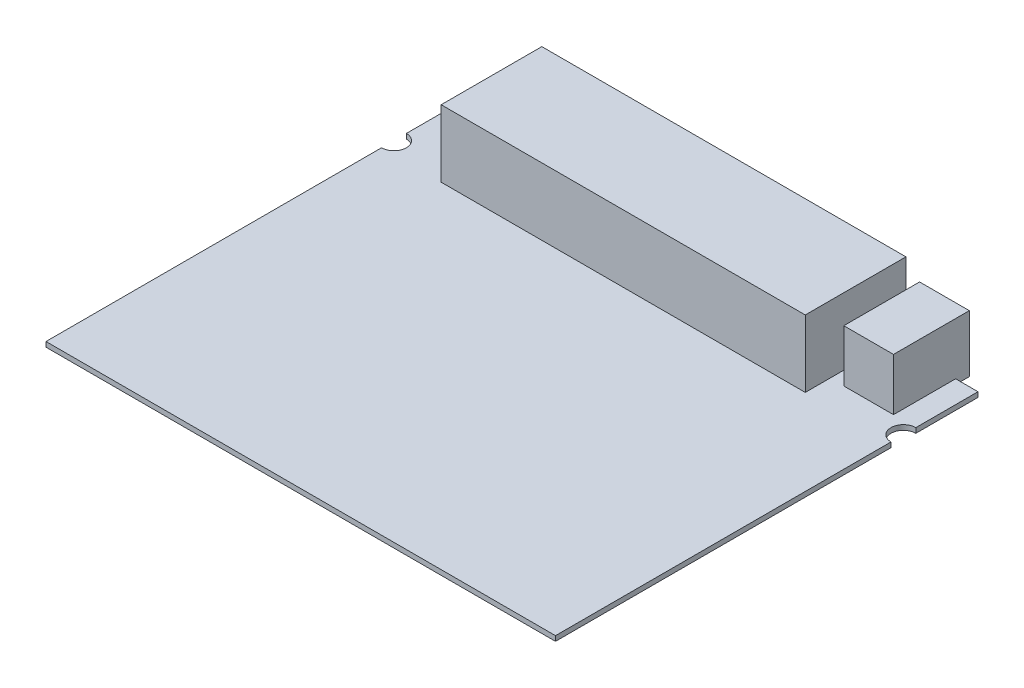
ISO-10303-21;
HEADER;
FILE_DESCRIPTION(('STEP AP214'),'2;1');
FILE_NAME('part.step','',(''),(''),'','','');
FILE_SCHEMA(('AUTOMOTIVE_DESIGN { 1 0 10303 214 1 1 1 1 }'));
ENDSEC;
DATA;
#1=APPLICATION_CONTEXT('core data for automotive mechanical design processes');
#2=APPLICATION_PROTOCOL_DEFINITION('international standard','automotive_design',2000,#1);
#3=PRODUCT_CONTEXT('',#1,'mechanical');
#4=PRODUCT('Part','Part','',(#3));
#5=PRODUCT_RELATED_PRODUCT_CATEGORY('part','',(#4));
#6=PRODUCT_DEFINITION_FORMATION('','',#4);
#7=PRODUCT_DEFINITION_CONTEXT('part definition',#1,'design');
#8=PRODUCT_DEFINITION('design','',#6,#7);
#9=PRODUCT_DEFINITION_SHAPE('','',#8);
#10=(LENGTH_UNIT() NAMED_UNIT(*) SI_UNIT(.MILLI.,.METRE.));
#11=(NAMED_UNIT(*) PLANE_ANGLE_UNIT() SI_UNIT($,.RADIAN.));
#12=(NAMED_UNIT(*) SI_UNIT($,.STERADIAN.) SOLID_ANGLE_UNIT());
#13=UNCERTAINTY_MEASURE_WITH_UNIT(LENGTH_MEASURE(1.E-05),#10,'distance_accuracy_value','');
#14=(GEOMETRIC_REPRESENTATION_CONTEXT(3) GLOBAL_UNCERTAINTY_ASSIGNED_CONTEXT((#13)) GLOBAL_UNIT_ASSIGNED_CONTEXT((#10,
#11,#12)) REPRESENTATION_CONTEXT('',''));
#15=CARTESIAN_POINT('',(0.,0.,0.));
#16=DIRECTION('',(0.,0.,1.));
#17=DIRECTION('',(1.,0.,0.));
#18=AXIS2_PLACEMENT_3D('',#15,#16,#17);
#19=CARTESIAN_POINT('',(34.544,14.732,-25.4));
#20=DIRECTION('',(-1.,0.,0.));
#21=DIRECTION('',(0.,0.,1.));
#22=AXIS2_PLACEMENT_3D('',#19,#20,#21);
#23=PLANE('',#22);
#24=DIRECTION('',(0.,-1.,0.));
#25=VECTOR('',#24,1.);
#26=CARTESIAN_POINT('',(34.544,1.016,-43.18));
#27=LINE('',#26,#25);
#28=CARTESIAN_POINT('',(34.544,1.016,-43.18));
#29=VERTEX_POINT('',#28);
#30=CARTESIAN_POINT('',(34.544,0.,-43.18));
#31=VERTEX_POINT('',#30);
#32=EDGE_CURVE('E236',#29,#31,#27,.T.);
#33=ORIENTED_EDGE('',*,*,#32,.T.);
#34=DIRECTION('',(0.,0.,-1.));
#35=VECTOR('',#34,1.);
#36=CARTESIAN_POINT('',(34.544,0.,-25.4));
#37=LINE('',#36,#35);
#38=CARTESIAN_POINT('',(34.544,0.,-45.974));
#39=VERTEX_POINT('',#38);
#40=EDGE_CURVE('E289',#31,#39,#37,.T.);
#41=ORIENTED_EDGE('',*,*,#40,.T.);
#42=DIRECTION('',(0.,-1.,0.));
#43=VECTOR('',#42,1.);
#44=CARTESIAN_POINT('',(34.544,14.732,-45.974));
#45=LINE('',#44,#43);
#46=CARTESIAN_POINT('',(34.544,14.732,-45.974));
#47=VERTEX_POINT('',#46);
#48=EDGE_CURVE('E41',#47,#39,#45,.T.);
#49=ORIENTED_EDGE('',*,*,#48,.F.);
#50=DIRECTION('',(0.,0.,-1.));
#51=VECTOR('',#50,1.);
#52=CARTESIAN_POINT('',(34.544,14.732,-25.4));
#53=LINE('',#52,#51);
#54=CARTESIAN_POINT('',(34.544,14.732,-25.4));
#55=VERTEX_POINT('',#54);
#56=EDGE_CURVE('E293',#55,#47,#53,.T.);
#57=ORIENTED_EDGE('',*,*,#56,.F.);
#58=DIRECTION('',(0.,-1.,0.));
#59=VECTOR('',#58,1.);
#60=CARTESIAN_POINT('',(34.544,14.732,-25.4));
#61=LINE('',#60,#59);
#62=CARTESIAN_POINT('',(34.544,1.016,-25.4));
#63=VERTEX_POINT('',#62);
#64=EDGE_CURVE('E11',#55,#63,#61,.T.);
#65=ORIENTED_EDGE('',*,*,#64,.T.);
#66=DIRECTION('',(0.,0.,1.));
#67=VECTOR('',#66,1.);
#68=CARTESIAN_POINT('',(34.544,1.016,-25.4));
#69=LINE('',#68,#67);
#70=EDGE_CURVE('E47',#29,#63,#69,.T.);
#71=ORIENTED_EDGE('',*,*,#70,.F.);
#72=EDGE_LOOP('',(#33,#41,#49,#57,#65,#71));
#73=FACE_BOUND('',#72,.T.);
#74=ADVANCED_FACE('F33',(#73),#23,.F.);
#75=CARTESIAN_POINT('',(-39.878,14.732,-25.4));
#76=DIRECTION('',(1.,0.,0.));
#77=DIRECTION('',(0.,0.,-1.));
#78=AXIS2_PLACEMENT_3D('',#75,#76,#77);
#79=PLANE('',#78);
#80=DIRECTION('',(0.,-1.,0.));
#81=VECTOR('',#80,1.);
#82=CARTESIAN_POINT('',(-39.878,1.016,-43.18));
#83=LINE('',#82,#81);
#84=CARTESIAN_POINT('',(-39.878,1.016,-43.18));
#85=VERTEX_POINT('',#84);
#86=CARTESIAN_POINT('',(-39.878,0.,-43.18));
#87=VERTEX_POINT('',#86);
#88=EDGE_CURVE('E286',#85,#87,#83,.T.);
#89=ORIENTED_EDGE('',*,*,#88,.F.);
#90=DIRECTION('',(0.,0.,-1.));
#91=VECTOR('',#90,1.);
#92=CARTESIAN_POINT('',(-39.878,1.016,-25.4));
#93=LINE('',#92,#91);
#94=CARTESIAN_POINT('',(-39.878,1.016,-25.4));
#95=VERTEX_POINT('',#94);
#96=EDGE_CURVE('E204',#95,#85,#93,.T.);
#97=ORIENTED_EDGE('',*,*,#96,.F.);
#98=DIRECTION('',(0.,-1.,0.));
#99=VECTOR('',#98,1.);
#100=CARTESIAN_POINT('',(-39.878,14.732,-25.4));
#101=LINE('',#100,#99);
#102=CARTESIAN_POINT('',(-39.878,14.732,-25.4));
#103=VERTEX_POINT('',#102);
#104=EDGE_CURVE('E300',#103,#95,#101,.T.);
#105=ORIENTED_EDGE('',*,*,#104,.F.);
#106=DIRECTION('',(0.,0.,1.));
#107=VECTOR('',#106,1.);
#108=CARTESIAN_POINT('',(-39.878,14.732,-25.4));
#109=LINE('',#108,#107);
#110=CARTESIAN_POINT('',(-39.878,14.732,-45.974));
#111=VERTEX_POINT('',#110);
#112=EDGE_CURVE('E298',#111,#103,#109,.T.);
#113=ORIENTED_EDGE('',*,*,#112,.F.);
#114=DIRECTION('',(0.,-1.,0.));
#115=VECTOR('',#114,1.);
#116=CARTESIAN_POINT('',(-39.878,14.732,-45.974));
#117=LINE('',#116,#115);
#118=CARTESIAN_POINT('',(-39.878,0.,-45.974));
#119=VERTEX_POINT('',#118);
#120=EDGE_CURVE('E306',#111,#119,#117,.T.);
#121=ORIENTED_EDGE('',*,*,#120,.T.);
#122=DIRECTION('',(0.,0.,1.));
#123=VECTOR('',#122,1.);
#124=CARTESIAN_POINT('',(-39.878,0.,-25.4));
#125=LINE('',#124,#123);
#126=EDGE_CURVE('E294',#119,#87,#125,.T.);
#127=ORIENTED_EDGE('',*,*,#126,.T.);
#128=EDGE_LOOP('',(#89,#97,#105,#113,#121,#127));
#129=FACE_BOUND('',#128,.T.);
#130=ADVANCED_FACE('F323',(#129),#79,.F.);
#131=CARTESIAN_POINT('',(-39.878,14.732,-25.4));
#132=DIRECTION('',(0.,0.,-1.));
#133=DIRECTION('',(-1.,0.,0.));
#134=AXIS2_PLACEMENT_3D('',#131,#132,#133);
#135=PLANE('',#134);
#136=ORIENTED_EDGE('',*,*,#104,.T.);
#137=DIRECTION('',(-1.,0.,0.));
#138=VECTOR('',#137,1.);
#139=CARTESIAN_POINT('',(-39.878,1.016,-25.4));
#140=LINE('',#139,#138);
#141=EDGE_CURVE('E55',#63,#95,#140,.T.);
#142=ORIENTED_EDGE('',*,*,#141,.F.);
#143=ORIENTED_EDGE('',*,*,#64,.F.);
#144=DIRECTION('',(1.,0.,0.));
#145=VECTOR('',#144,1.);
#146=CARTESIAN_POINT('',(-39.878,14.732,-25.4));
#147=LINE('',#146,#145);
#148=EDGE_CURVE('E290',#103,#55,#147,.T.);
#149=ORIENTED_EDGE('',*,*,#148,.F.);
#150=EDGE_LOOP('',(#136,#142,#143,#149));
#151=FACE_BOUND('',#150,.T.);
#152=ADVANCED_FACE('F35',(#151),#135,.F.);
#153=CARTESIAN_POINT('',(-39.878,14.732,-45.974));
#154=DIRECTION('',(0.,0.,1.));
#155=DIRECTION('',(1.,0.,0.));
#156=AXIS2_PLACEMENT_3D('',#153,#154,#155);
#157=PLANE('',#156);
#158=DIRECTION('',(-1.,0.,0.));
#159=VECTOR('',#158,1.);
#160=CARTESIAN_POINT('',(-39.878,0.,-45.974));
#161=LINE('',#160,#159);
#162=EDGE_CURVE('E302',#39,#119,#161,.T.);
#163=ORIENTED_EDGE('',*,*,#162,.T.);
#164=ORIENTED_EDGE('',*,*,#120,.F.);
#165=DIRECTION('',(-1.,0.,0.));
#166=VECTOR('',#165,1.);
#167=CARTESIAN_POINT('',(-39.878,14.732,-45.974));
#168=LINE('',#167,#166);
#169=EDGE_CURVE('E296',#47,#111,#168,.T.);
#170=ORIENTED_EDGE('',*,*,#169,.F.);
#171=ORIENTED_EDGE('',*,*,#48,.T.);
#172=EDGE_LOOP('',(#163,#164,#170,#171));
#173=FACE_BOUND('',#172,.T.);
#174=ADVANCED_FACE('F313',(#173),#157,.F.);
#175=CARTESIAN_POINT('',(0.,14.732,0.));
#176=DIRECTION('',(0.,1.,0.));
#177=DIRECTION('',(0.,0.,1.));
#178=AXIS2_PLACEMENT_3D('',#175,#176,#177);
#179=PLANE('',#178);
#180=ORIENTED_EDGE('',*,*,#148,.T.);
#181=ORIENTED_EDGE('',*,*,#56,.T.);
#182=ORIENTED_EDGE('',*,*,#169,.T.);
#183=ORIENTED_EDGE('',*,*,#112,.T.);
#184=EDGE_LOOP('',(#180,#181,#182,#183));
#185=FACE_BOUND('',#184,.T.);
#186=ADVANCED_FACE('F329',(#185),#179,.T.);
#187=CARTESIAN_POINT('',(0.,0.,0.));
#188=DIRECTION('',(0.,1.,0.));
#189=DIRECTION('',(0.,0.,1.));
#190=AXIS2_PLACEMENT_3D('',#187,#188,#189);
#191=PLANE('',#190);
#192=DIRECTION('',(-1.,0.,0.));
#193=VECTOR('',#192,1.);
#194=CARTESIAN_POINT('',(-39.878,0.,-43.18));
#195=LINE('',#194,#193);
#196=CARTESIAN_POINT('',(-52.07,0.,-43.18));
#197=VERTEX_POINT('',#196);
#198=EDGE_CURVE('E196',#87,#197,#195,.T.);
#199=ORIENTED_EDGE('',*,*,#198,.F.);
#200=ORIENTED_EDGE('',*,*,#126,.F.);
#201=ORIENTED_EDGE('',*,*,#162,.F.);
#202=ORIENTED_EDGE('',*,*,#40,.F.);
#203=DIRECTION('',(-1.,0.,0.));
#204=VECTOR('',#203,1.);
#205=CARTESIAN_POINT('',(37.338,0.,-43.18));
#206=LINE('',#205,#204);
#207=CARTESIAN_POINT('',(37.338,0.,-43.18));
#208=VERTEX_POINT('',#207);
#209=EDGE_CURVE('E208',#208,#31,#206,.T.);
#210=ORIENTED_EDGE('',*,*,#209,.F.);
#211=DIRECTION('',(0.,0.,1.));
#212=VECTOR('',#211,1.);
#213=CARTESIAN_POINT('',(37.338,0.,-30.48));
#214=LINE('',#213,#212);
#215=CARTESIAN_POINT('',(37.338,0.,-45.974));
#216=VERTEX_POINT('',#215);
#217=EDGE_CURVE('E191',#216,#208,#214,.T.);
#218=ORIENTED_EDGE('',*,*,#217,.F.);
#219=DIRECTION('',(-1.,0.,0.));
#220=VECTOR('',#219,1.);
#221=CARTESIAN_POINT('',(37.338,0.,-45.974));
#222=LINE('',#221,#220);
#223=CARTESIAN_POINT('',(47.498,0.,-45.974));
#224=VERTEX_POINT('',#223);
#225=EDGE_CURVE('E339',#224,#216,#222,.T.);
#226=ORIENTED_EDGE('',*,*,#225,.F.);
#227=DIRECTION('',(0.,0.,-1.));
#228=VECTOR('',#227,1.);
#229=CARTESIAN_POINT('',(47.498,0.,-30.48));
#230=LINE('',#229,#228);
#231=CARTESIAN_POINT('',(47.498,0.,-43.18));
#232=VERTEX_POINT('',#231);
#233=EDGE_CURVE('E343',#232,#224,#230,.T.);
#234=ORIENTED_EDGE('',*,*,#233,.F.);
#235=DIRECTION('',(-1.,0.,0.));
#236=VECTOR('',#235,1.);
#237=CARTESIAN_POINT('',(52.07,0.,-43.18));
#238=LINE('',#237,#236);
#239=CARTESIAN_POINT('',(52.07,0.,-43.18));
#240=VERTEX_POINT('',#239);
#241=EDGE_CURVE('E251',#240,#232,#238,.T.);
#242=ORIENTED_EDGE('',*,*,#241,.F.);
#243=DIRECTION('',(0.,0.,-1.));
#244=VECTOR('',#243,1.);
#245=CARTESIAN_POINT('',(52.07,0.,-30.48));
#246=LINE('',#245,#244);
#247=CARTESIAN_POINT('',(52.07,0.,-30.48));
#248=VERTEX_POINT('',#247);
#249=EDGE_CURVE('E249',#248,#240,#246,.T.);
#250=ORIENTED_EDGE('',*,*,#249,.F.);
#251=CARTESIAN_POINT('',(52.07,0.,-27.94));
#252=DIRECTION('',(0.,-1.,0.));
#253=DIRECTION('',(0.,0.,1.));
#254=AXIS2_PLACEMENT_3D('',#251,#252,#253);
#255=CIRCLE('',#254,2.53999999999999);
#256=CARTESIAN_POINT('',(52.07,0.,-25.4));
#257=VERTEX_POINT('',#256);
#258=EDGE_CURVE('E247',#257,#248,#255,.T.);
#259=ORIENTED_EDGE('',*,*,#258,.F.);
#260=DIRECTION('',(0.,0.,-1.));
#261=VECTOR('',#260,1.);
#262=CARTESIAN_POINT('',(52.07,0.,43.18));
#263=LINE('',#262,#261);
#264=CARTESIAN_POINT('',(52.07,0.,43.18));
#265=VERTEX_POINT('',#264);
#266=EDGE_CURVE('E245',#265,#257,#263,.T.);
#267=ORIENTED_EDGE('',*,*,#266,.F.);
#268=DIRECTION('',(1.,0.,0.));
#269=VECTOR('',#268,1.);
#270=CARTESIAN_POINT('',(-52.07,0.,43.18));
#271=LINE('',#270,#269);
#272=CARTESIAN_POINT('',(-52.07,0.,43.18));
#273=VERTEX_POINT('',#272);
#274=EDGE_CURVE('E243',#273,#265,#271,.T.);
#275=ORIENTED_EDGE('',*,*,#274,.F.);
#276=DIRECTION('',(0.,0.,1.));
#277=VECTOR('',#276,1.);
#278=CARTESIAN_POINT('',(-52.07,0.,43.18));
#279=LINE('',#278,#277);
#280=CARTESIAN_POINT('',(-52.07,0.,-25.4));
#281=VERTEX_POINT('',#280);
#282=EDGE_CURVE('E241',#281,#273,#279,.T.);
#283=ORIENTED_EDGE('',*,*,#282,.F.);
#284=CARTESIAN_POINT('',(-52.07,0.,-27.94));
#285=DIRECTION('',(0.,-1.,0.));
#286=DIRECTION('',(0.,0.,1.));
#287=AXIS2_PLACEMENT_3D('',#284,#285,#286);
#288=CIRCLE('',#287,2.53999999999999);
#289=CARTESIAN_POINT('',(-52.07,0.,-30.48));
#290=VERTEX_POINT('',#289);
#291=EDGE_CURVE('E239',#290,#281,#288,.T.);
#292=ORIENTED_EDGE('',*,*,#291,.F.);
#293=DIRECTION('',(0.,0.,1.));
#294=VECTOR('',#293,1.);
#295=CARTESIAN_POINT('',(-52.07,0.,-30.48));
#296=LINE('',#295,#294);
#297=EDGE_CURVE('E198',#197,#290,#296,.T.);
#298=ORIENTED_EDGE('',*,*,#297,.F.);
#299=EDGE_LOOP('',(#199,#200,#201,#202,#210,#218,#226,#234,#242,#250,#259,#267,#275,#283,#292,#298));
#300=FACE_BOUND('',#299,.T.);
#301=ADVANCED_FACE('F319',(#300),#191,.F.);
#302=CARTESIAN_POINT('',(-39.878,1.016,-43.18));
#303=DIRECTION('',(0.,0.,1.));
#304=DIRECTION('',(1.,0.,0.));
#305=AXIS2_PLACEMENT_3D('',#302,#303,#304);
#306=PLANE('',#305);
#307=ORIENTED_EDGE('',*,*,#198,.T.);
#308=DIRECTION('',(0.,-1.,0.));
#309=VECTOR('',#308,1.);
#310=CARTESIAN_POINT('',(-52.07,1.016,-43.18));
#311=LINE('',#310,#309);
#312=CARTESIAN_POINT('',(-52.07,1.016,-43.18));
#313=VERTEX_POINT('',#312);
#314=EDGE_CURVE('E283',#313,#197,#311,.T.);
#315=ORIENTED_EDGE('',*,*,#314,.F.);
#316=DIRECTION('',(-1.,0.,0.));
#317=VECTOR('',#316,1.);
#318=CARTESIAN_POINT('',(-39.878,1.016,-43.18));
#319=LINE('',#318,#317);
#320=EDGE_CURVE('E207',#85,#313,#319,.T.);
#321=ORIENTED_EDGE('',*,*,#320,.F.);
#322=ORIENTED_EDGE('',*,*,#88,.T.);
#323=EDGE_LOOP('',(#307,#315,#321,#322));
#324=FACE_BOUND('',#323,.T.);
#325=ADVANCED_FACE('F395',(#324),#306,.F.);
#326=CARTESIAN_POINT('',(-52.07,1.016,-30.48));
#327=DIRECTION('',(1.,0.,0.));
#328=DIRECTION('',(0.,0.,-1.));
#329=AXIS2_PLACEMENT_3D('',#326,#327,#328);
#330=PLANE('',#329);
#331=ORIENTED_EDGE('',*,*,#297,.T.);
#332=DIRECTION('',(0.,-1.,0.));
#333=VECTOR('',#332,1.);
#334=CARTESIAN_POINT('',(-52.07,1.016,-30.48));
#335=LINE('',#334,#333);
#336=CARTESIAN_POINT('',(-52.07,1.016,-30.48));
#337=VERTEX_POINT('',#336);
#338=EDGE_CURVE('E280',#337,#290,#335,.T.);
#339=ORIENTED_EDGE('',*,*,#338,.F.);
#340=DIRECTION('',(0.,0.,1.));
#341=VECTOR('',#340,1.);
#342=CARTESIAN_POINT('',(-52.07,1.016,-30.48));
#343=LINE('',#342,#341);
#344=EDGE_CURVE('E210',#313,#337,#343,.T.);
#345=ORIENTED_EDGE('',*,*,#344,.F.);
#346=ORIENTED_EDGE('',*,*,#314,.T.);
#347=EDGE_LOOP('',(#331,#339,#345,#346));
#348=FACE_BOUND('',#347,.T.);
#349=ADVANCED_FACE('F392',(#348),#330,.F.);
#350=CARTESIAN_POINT('',(-52.07,1.016,-27.94));
#351=DIRECTION('',(0.,-1.,0.));
#352=DIRECTION('',(0.,0.,-1.));
#353=AXIS2_PLACEMENT_3D('',#350,#351,#352);
#354=CYLINDRICAL_SURFACE('',#353,2.53999999999999);
#355=ORIENTED_EDGE('',*,*,#291,.T.);
#356=DIRECTION('',(0.,-1.,0.));
#357=VECTOR('',#356,1.);
#358=CARTESIAN_POINT('',(-52.07,1.016,-25.4));
#359=LINE('',#358,#357);
#360=CARTESIAN_POINT('',(-52.07,1.016,-25.4));
#361=VERTEX_POINT('',#360);
#362=EDGE_CURVE('E277',#361,#281,#359,.T.);
#363=ORIENTED_EDGE('',*,*,#362,.F.);
#364=CARTESIAN_POINT('',(-52.07,1.016,-27.94));
#365=DIRECTION('',(0.,-1.,0.));
#366=DIRECTION('',(0.,0.,1.));
#367=AXIS2_PLACEMENT_3D('',#364,#365,#366);
#368=CIRCLE('',#367,2.53999999999999);
#369=EDGE_CURVE('E212',#337,#361,#368,.T.);
#370=ORIENTED_EDGE('',*,*,#369,.F.);
#371=ORIENTED_EDGE('',*,*,#338,.T.);
#372=EDGE_LOOP('',(#355,#363,#370,#371));
#373=FACE_BOUND('',#372,.T.);
#374=ADVANCED_FACE('F388',(#373),#354,.F.);
#375=CARTESIAN_POINT('',(-52.07,1.016,43.18));
#376=DIRECTION('',(1.,0.,0.));
#377=DIRECTION('',(0.,0.,-1.));
#378=AXIS2_PLACEMENT_3D('',#375,#376,#377);
#379=PLANE('',#378);
#380=ORIENTED_EDGE('',*,*,#282,.T.);
#381=DIRECTION('',(0.,-1.,0.));
#382=VECTOR('',#381,1.);
#383=CARTESIAN_POINT('',(-52.07,1.016,43.18));
#384=LINE('',#383,#382);
#385=CARTESIAN_POINT('',(-52.07,1.016,43.18));
#386=VERTEX_POINT('',#385);
#387=EDGE_CURVE('E274',#386,#273,#384,.T.);
#388=ORIENTED_EDGE('',*,*,#387,.F.);
#389=DIRECTION('',(0.,0.,1.));
#390=VECTOR('',#389,1.);
#391=CARTESIAN_POINT('',(-52.07,1.016,43.18));
#392=LINE('',#391,#390);
#393=EDGE_CURVE('E214',#361,#386,#392,.T.);
#394=ORIENTED_EDGE('',*,*,#393,.F.);
#395=ORIENTED_EDGE('',*,*,#362,.T.);
#396=EDGE_LOOP('',(#380,#388,#394,#395));
#397=FACE_BOUND('',#396,.T.);
#398=ADVANCED_FACE('F383',(#397),#379,.F.);
#399=CARTESIAN_POINT('',(-52.07,1.016,43.18));
#400=DIRECTION('',(0.,0.,-1.));
#401=DIRECTION('',(-1.,0.,0.));
#402=AXIS2_PLACEMENT_3D('',#399,#400,#401);
#403=PLANE('',#402);
#404=ORIENTED_EDGE('',*,*,#274,.T.);
#405=DIRECTION('',(0.,-1.,0.));
#406=VECTOR('',#405,1.);
#407=CARTESIAN_POINT('',(52.07,1.016,43.18));
#408=LINE('',#407,#406);
#409=CARTESIAN_POINT('',(52.07,1.016,43.18));
#410=VERTEX_POINT('',#409);
#411=EDGE_CURVE('E271',#410,#265,#408,.T.);
#412=ORIENTED_EDGE('',*,*,#411,.F.);
#413=DIRECTION('',(1.,0.,0.));
#414=VECTOR('',#413,1.);
#415=CARTESIAN_POINT('',(-52.07,1.016,43.18));
#416=LINE('',#415,#414);
#417=EDGE_CURVE('E216',#386,#410,#416,.T.);
#418=ORIENTED_EDGE('',*,*,#417,.F.);
#419=ORIENTED_EDGE('',*,*,#387,.T.);
#420=EDGE_LOOP('',(#404,#412,#418,#419));
#421=FACE_BOUND('',#420,.T.);
#422=ADVANCED_FACE('F378',(#421),#403,.F.);
#423=CARTESIAN_POINT('',(52.07,1.016,43.18));
#424=DIRECTION('',(-1.,0.,0.));
#425=DIRECTION('',(0.,0.,1.));
#426=AXIS2_PLACEMENT_3D('',#423,#424,#425);
#427=PLANE('',#426);
#428=ORIENTED_EDGE('',*,*,#266,.T.);
#429=DIRECTION('',(0.,-1.,0.));
#430=VECTOR('',#429,1.);
#431=CARTESIAN_POINT('',(52.07,1.016,-25.4));
#432=LINE('',#431,#430);
#433=CARTESIAN_POINT('',(52.07,1.016,-25.4));
#434=VERTEX_POINT('',#433);
#435=EDGE_CURVE('E268',#434,#257,#432,.T.);
#436=ORIENTED_EDGE('',*,*,#435,.F.);
#437=DIRECTION('',(0.,0.,-1.));
#438=VECTOR('',#437,1.);
#439=CARTESIAN_POINT('',(52.07,1.016,43.18));
#440=LINE('',#439,#438);
#441=EDGE_CURVE('E218',#410,#434,#440,.T.);
#442=ORIENTED_EDGE('',*,*,#441,.F.);
#443=ORIENTED_EDGE('',*,*,#411,.T.);
#444=EDGE_LOOP('',(#428,#436,#442,#443));
#445=FACE_BOUND('',#444,.T.);
#446=ADVANCED_FACE('F374',(#445),#427,.F.);
#447=CARTESIAN_POINT('',(52.07,1.016,-27.94));
#448=DIRECTION('',(0.,-1.,0.));
#449=DIRECTION('',(0.,0.,-1.));
#450=AXIS2_PLACEMENT_3D('',#447,#448,#449);
#451=CYLINDRICAL_SURFACE('',#450,2.53999999999999);
#452=ORIENTED_EDGE('',*,*,#258,.T.);
#453=DIRECTION('',(0.,-1.,0.));
#454=VECTOR('',#453,1.);
#455=CARTESIAN_POINT('',(52.07,1.016,-30.48));
#456=LINE('',#455,#454);
#457=CARTESIAN_POINT('',(52.07,1.016,-30.48));
#458=VERTEX_POINT('',#457);
#459=EDGE_CURVE('E265',#458,#248,#456,.T.);
#460=ORIENTED_EDGE('',*,*,#459,.F.);
#461=CARTESIAN_POINT('',(52.07,1.016,-27.94));
#462=DIRECTION('',(0.,-1.,0.));
#463=DIRECTION('',(0.,0.,1.));
#464=AXIS2_PLACEMENT_3D('',#461,#462,#463);
#465=CIRCLE('',#464,2.53999999999999);
#466=EDGE_CURVE('E220',#434,#458,#465,.T.);
#467=ORIENTED_EDGE('',*,*,#466,.F.);
#468=ORIENTED_EDGE('',*,*,#435,.T.);
#469=EDGE_LOOP('',(#452,#460,#467,#468));
#470=FACE_BOUND('',#469,.T.);
#471=ADVANCED_FACE('F369',(#470),#451,.F.);
#472=CARTESIAN_POINT('',(52.07,1.016,-30.48));
#473=DIRECTION('',(-1.,0.,0.));
#474=DIRECTION('',(0.,0.,1.));
#475=AXIS2_PLACEMENT_3D('',#472,#473,#474);
#476=PLANE('',#475);
#477=ORIENTED_EDGE('',*,*,#249,.T.);
#478=DIRECTION('',(0.,-1.,0.));
#479=VECTOR('',#478,1.);
#480=CARTESIAN_POINT('',(52.07,1.016,-43.18));
#481=LINE('',#480,#479);
#482=CARTESIAN_POINT('',(52.07,1.016,-43.18));
#483=VERTEX_POINT('',#482);
#484=EDGE_CURVE('E262',#483,#240,#481,.T.);
#485=ORIENTED_EDGE('',*,*,#484,.F.);
#486=DIRECTION('',(0.,0.,-1.));
#487=VECTOR('',#486,1.);
#488=CARTESIAN_POINT('',(52.07,1.016,-30.48));
#489=LINE('',#488,#487);
#490=EDGE_CURVE('E222',#458,#483,#489,.T.);
#491=ORIENTED_EDGE('',*,*,#490,.F.);
#492=ORIENTED_EDGE('',*,*,#459,.T.);
#493=EDGE_LOOP('',(#477,#485,#491,#492));
#494=FACE_BOUND('',#493,.T.);
#495=ADVANCED_FACE('F363',(#494),#476,.F.);
#496=CARTESIAN_POINT('',(52.07,1.016,-43.18));
#497=DIRECTION('',(0.,0.,1.));
#498=DIRECTION('',(1.,0.,0.));
#499=AXIS2_PLACEMENT_3D('',#496,#497,#498);
#500=PLANE('',#499);
#501=ORIENTED_EDGE('',*,*,#241,.T.);
#502=DIRECTION('',(0.,-1.,0.));
#503=VECTOR('',#502,1.);
#504=CARTESIAN_POINT('',(47.498,1.016,-43.18));
#505=LINE('',#504,#503);
#506=CARTESIAN_POINT('',(47.498,1.016,-43.18));
#507=VERTEX_POINT('',#506);
#508=EDGE_CURVE('E260',#507,#232,#505,.T.);
#509=ORIENTED_EDGE('',*,*,#508,.F.);
#510=DIRECTION('',(-1.,0.,0.));
#511=VECTOR('',#510,1.);
#512=CARTESIAN_POINT('',(52.07,1.016,-43.18));
#513=LINE('',#512,#511);
#514=EDGE_CURVE('E224',#483,#507,#513,.T.);
#515=ORIENTED_EDGE('',*,*,#514,.F.);
#516=ORIENTED_EDGE('',*,*,#484,.T.);
#517=EDGE_LOOP('',(#501,#509,#515,#516));
#518=FACE_BOUND('',#517,.T.);
#519=ADVANCED_FACE('F358',(#518),#500,.F.);
#520=CARTESIAN_POINT('',(37.338,1.016,-43.18));
#521=DIRECTION('',(0.,0.,1.));
#522=DIRECTION('',(1.,0.,0.));
#523=AXIS2_PLACEMENT_3D('',#520,#521,#522);
#524=PLANE('',#523);
#525=ORIENTED_EDGE('',*,*,#209,.T.);
#526=ORIENTED_EDGE('',*,*,#32,.F.);
#527=DIRECTION('',(-1.,0.,0.));
#528=VECTOR('',#527,1.);
#529=CARTESIAN_POINT('',(37.338,1.016,-43.18));
#530=LINE('',#529,#528);
#531=CARTESIAN_POINT('',(37.338,1.016,-43.18));
#532=VERTEX_POINT('',#531);
#533=EDGE_CURVE('E233',#532,#29,#530,.T.);
#534=ORIENTED_EDGE('',*,*,#533,.F.);
#535=DIRECTION('',(0.,-1.,0.));
#536=VECTOR('',#535,1.);
#537=CARTESIAN_POINT('',(37.338,1.016,-43.18));
#538=LINE('',#537,#536);
#539=EDGE_CURVE('E257',#532,#208,#538,.T.);
#540=ORIENTED_EDGE('',*,*,#539,.T.);
#541=EDGE_LOOP('',(#525,#526,#534,#540));
#542=FACE_BOUND('',#541,.T.);
#543=ADVANCED_FACE('F335',(#542),#524,.F.);
#544=CARTESIAN_POINT('',(-52.07,1.016,-27.94));
#545=DIRECTION('',(0.,1.,0.));
#546=DIRECTION('',(0.,0.,1.));
#547=AXIS2_PLACEMENT_3D('',#544,#545,#546);
#548=PLANE('',#547);
#549=ORIENTED_EDGE('',*,*,#96,.T.);
#550=ORIENTED_EDGE('',*,*,#320,.T.);
#551=ORIENTED_EDGE('',*,*,#344,.T.);
#552=ORIENTED_EDGE('',*,*,#369,.T.);
#553=ORIENTED_EDGE('',*,*,#393,.T.);
#554=ORIENTED_EDGE('',*,*,#417,.T.);
#555=ORIENTED_EDGE('',*,*,#441,.T.);
#556=ORIENTED_EDGE('',*,*,#466,.T.);
#557=ORIENTED_EDGE('',*,*,#490,.T.);
#558=ORIENTED_EDGE('',*,*,#514,.T.);
#559=DIRECTION('',(0.,0.,1.));
#560=VECTOR('',#559,1.);
#561=CARTESIAN_POINT('',(47.498,1.016,-30.48));
#562=LINE('',#561,#560);
#563=CARTESIAN_POINT('',(47.498,1.016,-30.48));
#564=VERTEX_POINT('',#563);
#565=EDGE_CURVE('E227',#507,#564,#562,.T.);
#566=ORIENTED_EDGE('',*,*,#565,.T.);
#567=DIRECTION('',(-1.,0.,0.));
#568=VECTOR('',#567,1.);
#569=CARTESIAN_POINT('',(47.498,1.016,-30.48));
#570=LINE('',#569,#568);
#571=CARTESIAN_POINT('',(37.338,1.016,-30.48));
#572=VERTEX_POINT('',#571);
#573=EDGE_CURVE('E195',#564,#572,#570,.T.);
#574=ORIENTED_EDGE('',*,*,#573,.T.);
#575=DIRECTION('',(0.,0.,-1.));
#576=VECTOR('',#575,1.);
#577=CARTESIAN_POINT('',(37.338,1.016,-30.48));
#578=LINE('',#577,#576);
#579=EDGE_CURVE('E230',#572,#532,#578,.T.);
#580=ORIENTED_EDGE('',*,*,#579,.T.);
#581=ORIENTED_EDGE('',*,*,#533,.T.);
#582=ORIENTED_EDGE('',*,*,#70,.T.);
#583=ORIENTED_EDGE('',*,*,#141,.T.);
#584=EDGE_LOOP('',(#549,#550,#551,#552,#553,#554,#555,#556,#557,#558,#566,#574,#580,#581,#582,#583));
#585=FACE_BOUND('',#584,.T.);
#586=ADVANCED_FACE('F331',(#585),#548,.T.);
#587=CARTESIAN_POINT('',(47.498,11.684,-30.48));
#588=DIRECTION('',(-1.,0.,0.));
#589=DIRECTION('',(0.,0.,1.));
#590=AXIS2_PLACEMENT_3D('',#587,#588,#589);
#591=PLANE('',#590);
#592=ORIENTED_EDGE('',*,*,#565,.F.);
#593=ORIENTED_EDGE('',*,*,#508,.T.);
#594=ORIENTED_EDGE('',*,*,#233,.T.);
#595=DIRECTION('',(0.,-1.,0.));
#596=VECTOR('',#595,1.);
#597=CARTESIAN_POINT('',(47.498,11.684,-45.974));
#598=LINE('',#597,#596);
#599=CARTESIAN_POINT('',(47.498,11.684,-45.974));
#600=VERTEX_POINT('',#599);
#601=EDGE_CURVE('E178',#600,#224,#598,.T.);
#602=ORIENTED_EDGE('',*,*,#601,.F.);
#603=DIRECTION('',(0.,0.,-1.));
#604=VECTOR('',#603,1.);
#605=CARTESIAN_POINT('',(47.498,11.684,-30.48));
#606=LINE('',#605,#604);
#607=CARTESIAN_POINT('',(47.498,11.684,-30.48));
#608=VERTEX_POINT('',#607);
#609=EDGE_CURVE('E171',#608,#600,#606,.T.);
#610=ORIENTED_EDGE('',*,*,#609,.F.);
#611=DIRECTION('',(0.,-1.,0.));
#612=VECTOR('',#611,1.);
#613=CARTESIAN_POINT('',(47.498,11.684,-30.48));
#614=LINE('',#613,#612);
#615=EDGE_CURVE('E175',#608,#564,#614,.T.);
#616=ORIENTED_EDGE('',*,*,#615,.T.);
#617=EDGE_LOOP('',(#592,#593,#594,#602,#610,#616));
#618=FACE_BOUND('',#617,.T.);
#619=ADVANCED_FACE('F173',(#618),#591,.F.);
#620=CARTESIAN_POINT('',(37.338,11.684,-30.48));
#621=DIRECTION('',(1.,0.,0.));
#622=DIRECTION('',(0.,0.,-1.));
#623=AXIS2_PLACEMENT_3D('',#620,#621,#622);
#624=PLANE('',#623);
#625=ORIENTED_EDGE('',*,*,#217,.T.);
#626=ORIENTED_EDGE('',*,*,#539,.F.);
#627=ORIENTED_EDGE('',*,*,#579,.F.);
#628=DIRECTION('',(0.,-1.,0.));
#629=VECTOR('',#628,1.);
#630=CARTESIAN_POINT('',(37.338,11.684,-30.48));
#631=LINE('',#630,#629);
#632=CARTESIAN_POINT('',(37.338,11.684,-30.48));
#633=VERTEX_POINT('',#632);
#634=EDGE_CURVE('E347',#633,#572,#631,.T.);
#635=ORIENTED_EDGE('',*,*,#634,.F.);
#636=DIRECTION('',(0.,0.,1.));
#637=VECTOR('',#636,1.);
#638=CARTESIAN_POINT('',(37.338,11.684,-30.48));
#639=LINE('',#638,#637);
#640=CARTESIAN_POINT('',(37.338,11.684,-45.974));
#641=VERTEX_POINT('',#640);
#642=EDGE_CURVE('E187',#641,#633,#639,.T.);
#643=ORIENTED_EDGE('',*,*,#642,.F.);
#644=DIRECTION('',(0.,-1.,0.));
#645=VECTOR('',#644,1.);
#646=CARTESIAN_POINT('',(37.338,11.684,-45.974));
#647=LINE('',#646,#645);
#648=EDGE_CURVE('E200',#641,#216,#647,.T.);
#649=ORIENTED_EDGE('',*,*,#648,.T.);
#650=EDGE_LOOP('',(#625,#626,#627,#635,#643,#649));
#651=FACE_BOUND('',#650,.T.);
#652=ADVANCED_FACE('F349',(#651),#624,.F.);
#653=CARTESIAN_POINT('',(47.498,11.684,-30.48));
#654=DIRECTION('',(0.,0.,-1.));
#655=DIRECTION('',(-1.,0.,0.));
#656=AXIS2_PLACEMENT_3D('',#653,#654,#655);
#657=PLANE('',#656);
#658=ORIENTED_EDGE('',*,*,#573,.F.);
#659=ORIENTED_EDGE('',*,*,#615,.F.);
#660=DIRECTION('',(1.,0.,0.));
#661=VECTOR('',#660,1.);
#662=CARTESIAN_POINT('',(47.498,11.684,-30.48));
#663=LINE('',#662,#661);
#664=EDGE_CURVE('E182',#633,#608,#663,.T.);
#665=ORIENTED_EDGE('',*,*,#664,.F.);
#666=ORIENTED_EDGE('',*,*,#634,.T.);
#667=EDGE_LOOP('',(#658,#659,#665,#666));
#668=FACE_BOUND('',#667,.T.);
#669=ADVANCED_FACE('F193',(#668),#657,.F.);
#670=CARTESIAN_POINT('',(37.338,11.684,-45.974));
#671=DIRECTION('',(0.,0.,1.));
#672=DIRECTION('',(1.,0.,0.));
#673=AXIS2_PLACEMENT_3D('',#670,#671,#672);
#674=PLANE('',#673);
#675=ORIENTED_EDGE('',*,*,#225,.T.);
#676=ORIENTED_EDGE('',*,*,#648,.F.);
#677=DIRECTION('',(-1.,0.,0.));
#678=VECTOR('',#677,1.);
#679=CARTESIAN_POINT('',(37.338,11.684,-45.974));
#680=LINE('',#679,#678);
#681=EDGE_CURVE('E181',#600,#641,#680,.T.);
#682=ORIENTED_EDGE('',*,*,#681,.F.);
#683=ORIENTED_EDGE('',*,*,#601,.T.);
#684=EDGE_LOOP('',(#675,#676,#682,#683));
#685=FACE_BOUND('',#684,.T.);
#686=ADVANCED_FACE('F351',(#685),#674,.F.);
#687=CARTESIAN_POINT('',(0.,11.684,0.));
#688=DIRECTION('',(0.,-1.,0.));
#689=DIRECTION('',(0.,0.,-1.));
#690=AXIS2_PLACEMENT_3D('',#687,#688,#689);
#691=PLANE('',#690);
#692=ORIENTED_EDGE('',*,*,#664,.T.);
#693=ORIENTED_EDGE('',*,*,#609,.T.);
#694=ORIENTED_EDGE('',*,*,#681,.T.);
#695=ORIENTED_EDGE('',*,*,#642,.T.);
#696=EDGE_LOOP('',(#692,#693,#694,#695));
#697=FACE_BOUND('',#696,.T.);
#698=ADVANCED_FACE('F185',(#697),#691,.F.);
#699=CLOSED_SHELL('',(#74,#130,#152,#174,#186,#301,#325,#349,#374,#398,#422,#446,#471,#495,#519,
#543,#586,#619,#652,#669,#686,#698));
#700=MANIFOLD_SOLID_BREP('B2',#699);
#701=ADVANCED_BREP_SHAPE_REPRESENTATION('',(#18,#700),#14);
#702=SHAPE_DEFINITION_REPRESENTATION(#9,#701);
ENDSEC;
END-ISO-10303-21;
